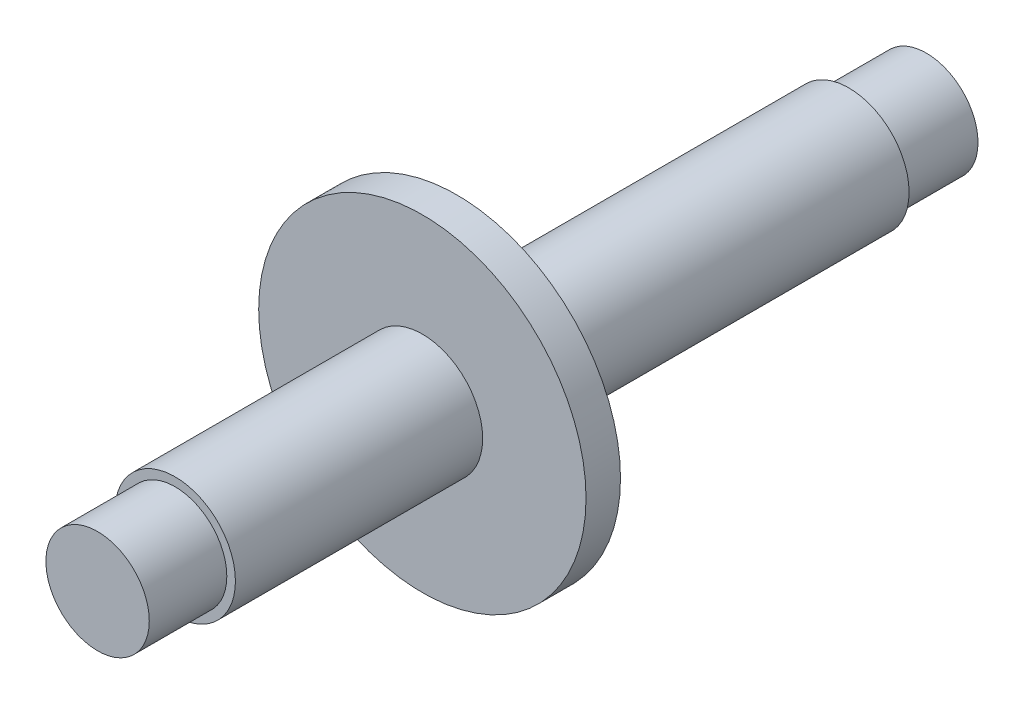
ISO-10303-21;
HEADER;
FILE_DESCRIPTION(('STEP AP214'),'2;1');
FILE_NAME('part.step','',(''),(''),'','','');
FILE_SCHEMA(('AUTOMOTIVE_DESIGN { 1 0 10303 214 1 1 1 1 }'));
ENDSEC;
DATA;
#1=APPLICATION_CONTEXT('core data for automotive mechanical design processes');
#2=APPLICATION_PROTOCOL_DEFINITION('international standard','automotive_design',2000,#1);
#3=PRODUCT_CONTEXT('',#1,'mechanical');
#4=PRODUCT('Part','Part','',(#3));
#5=PRODUCT_RELATED_PRODUCT_CATEGORY('part','',(#4));
#6=PRODUCT_DEFINITION_FORMATION('','',#4);
#7=PRODUCT_DEFINITION_CONTEXT('part definition',#1,'design');
#8=PRODUCT_DEFINITION('design','',#6,#7);
#9=PRODUCT_DEFINITION_SHAPE('','',#8);
#10=(LENGTH_UNIT() NAMED_UNIT(*) SI_UNIT(.MILLI.,.METRE.));
#11=(NAMED_UNIT(*) PLANE_ANGLE_UNIT() SI_UNIT($,.RADIAN.));
#12=(NAMED_UNIT(*) SI_UNIT($,.STERADIAN.) SOLID_ANGLE_UNIT());
#13=UNCERTAINTY_MEASURE_WITH_UNIT(LENGTH_MEASURE(1.E-05),#10,'distance_accuracy_value','');
#14=(GEOMETRIC_REPRESENTATION_CONTEXT(3) GLOBAL_UNCERTAINTY_ASSIGNED_CONTEXT((#13)) GLOBAL_UNIT_ASSIGNED_CONTEXT((#10,
#11,#12)) REPRESENTATION_CONTEXT('',''));
#15=CARTESIAN_POINT('',(0.,0.,0.));
#16=DIRECTION('',(0.,0.,1.));
#17=DIRECTION('',(1.,0.,0.));
#18=AXIS2_PLACEMENT_3D('',#15,#16,#17);
#19=CARTESIAN_POINT('',(0.,0.,4.5));
#20=DIRECTION('',(0.,0.,-1.));
#21=DIRECTION('',(-1.,0.,0.));
#22=AXIS2_PLACEMENT_3D('',#19,#20,#21);
#23=CYLINDRICAL_SURFACE('',#22,3.);
#24=CARTESIAN_POINT('',(0.,0.,4.5));
#25=DIRECTION('',(0.,0.,1.));
#26=DIRECTION('',(1.,0.,0.));
#27=AXIS2_PLACEMENT_3D('',#24,#25,#26);
#28=CIRCLE('',#27,3.);
#29=CARTESIAN_POINT('',(3.,0.,4.5));
#30=VERTEX_POINT('',#29);
#31=EDGE_CURVE('E10',#30,#30,#28,.T.);
#32=ORIENTED_EDGE('',*,*,#31,.F.);
#33=EDGE_LOOP('',(#32));
#34=FACE_BOUND('',#33,.T.);
#35=CARTESIAN_POINT('',(0.,0.,0.));
#36=DIRECTION('',(0.,0.,1.));
#37=DIRECTION('',(1.,0.,0.));
#38=AXIS2_PLACEMENT_3D('',#35,#36,#37);
#39=CIRCLE('',#38,3.);
#40=CARTESIAN_POINT('',(3.,0.,0.));
#41=VERTEX_POINT('',#40);
#42=EDGE_CURVE('E36',#41,#41,#39,.T.);
#43=ORIENTED_EDGE('',*,*,#42,.T.);
#44=EDGE_LOOP('',(#43));
#45=FACE_BOUND('',#44,.T.);
#46=ADVANCED_FACE('F33',(#34,#45),#23,.T.);
#47=CARTESIAN_POINT('',(0.,0.,0.));
#48=DIRECTION('',(0.,0.,1.));
#49=DIRECTION('',(1.,0.,0.));
#50=AXIS2_PLACEMENT_3D('',#47,#48,#49);
#51=PLANE('',#50);
#52=ORIENTED_EDGE('',*,*,#42,.F.);
#53=EDGE_LOOP('',(#52));
#54=FACE_BOUND('',#53,.T.);
#55=ADVANCED_FACE('F109',(#54),#51,.F.);
#56=CARTESIAN_POINT('',(0.,0.,27.25));
#57=DIRECTION('',(0.,0.,-1.));
#58=DIRECTION('',(-1.,0.,0.));
#59=AXIS2_PLACEMENT_3D('',#56,#57,#58);
#60=CYLINDRICAL_SURFACE('',#59,3.5);
#61=CARTESIAN_POINT('',(0.,0.,27.25));
#62=DIRECTION('',(0.,0.,1.));
#63=DIRECTION('',(1.,0.,0.));
#64=AXIS2_PLACEMENT_3D('',#61,#62,#63);
#65=CIRCLE('',#64,3.5);
#66=CARTESIAN_POINT('',(3.5,0.,27.25));
#67=VERTEX_POINT('',#66);
#68=EDGE_CURVE('E43',#67,#67,#65,.T.);
#69=ORIENTED_EDGE('',*,*,#68,.F.);
#70=EDGE_LOOP('',(#69));
#71=FACE_BOUND('',#70,.T.);
#72=CARTESIAN_POINT('',(0.,0.,4.5));
#73=DIRECTION('',(0.,0.,1.));
#74=DIRECTION('',(1.,0.,0.));
#75=AXIS2_PLACEMENT_3D('',#72,#73,#74);
#76=CIRCLE('',#75,3.5);
#77=CARTESIAN_POINT('',(3.5,0.,4.5));
#78=VERTEX_POINT('',#77);
#79=EDGE_CURVE('E45',#78,#78,#76,.T.);
#80=ORIENTED_EDGE('',*,*,#79,.T.);
#81=EDGE_LOOP('',(#80));
#82=FACE_BOUND('',#81,.T.);
#83=ADVANCED_FACE('F114',(#71,#82),#60,.T.);
#84=CARTESIAN_POINT('',(0.,0.,4.5));
#85=DIRECTION('',(0.,0.,1.));
#86=DIRECTION('',(1.,0.,0.));
#87=AXIS2_PLACEMENT_3D('',#84,#85,#86);
#88=PLANE('',#87);
#89=ORIENTED_EDGE('',*,*,#31,.T.);
#90=EDGE_LOOP('',(#89));
#91=FACE_BOUND('',#90,.T.);
#92=ORIENTED_EDGE('',*,*,#79,.F.);
#93=EDGE_LOOP('',(#92));
#94=FACE_BOUND('',#93,.T.);
#95=ADVANCED_FACE('F99',(#91,#94),#88,.F.);
#96=CARTESIAN_POINT('',(0.,0.,29.25));
#97=DIRECTION('',(0.,0.,-1.));
#98=DIRECTION('',(-1.,0.,0.));
#99=AXIS2_PLACEMENT_3D('',#96,#97,#98);
#100=CYLINDRICAL_SURFACE('',#99,9.5);
#101=CARTESIAN_POINT('',(0.,0.,29.25));
#102=DIRECTION('',(0.,0.,1.));
#103=DIRECTION('',(1.,0.,0.));
#104=AXIS2_PLACEMENT_3D('',#101,#102,#103);
#105=CIRCLE('',#104,9.5);
#106=CARTESIAN_POINT('',(9.5,0.,29.25));
#107=VERTEX_POINT('',#106);
#108=EDGE_CURVE('E48',#107,#107,#105,.T.);
#109=ORIENTED_EDGE('',*,*,#108,.F.);
#110=EDGE_LOOP('',(#109));
#111=FACE_BOUND('',#110,.T.);
#112=CARTESIAN_POINT('',(0.,0.,27.25));
#113=DIRECTION('',(0.,0.,1.));
#114=DIRECTION('',(1.,0.,0.));
#115=AXIS2_PLACEMENT_3D('',#112,#113,#114);
#116=CIRCLE('',#115,9.5);
#117=CARTESIAN_POINT('',(9.5,0.,27.25));
#118=VERTEX_POINT('',#117);
#119=EDGE_CURVE('E51',#118,#118,#116,.T.);
#120=ORIENTED_EDGE('',*,*,#119,.T.);
#121=EDGE_LOOP('',(#120));
#122=FACE_BOUND('',#121,.T.);
#123=ADVANCED_FACE('F93',(#111,#122),#100,.T.);
#124=CARTESIAN_POINT('',(0.,0.,29.25));
#125=DIRECTION('',(0.,0.,1.));
#126=DIRECTION('',(1.,0.,0.));
#127=AXIS2_PLACEMENT_3D('',#124,#125,#126);
#128=PLANE('',#127);
#129=CARTESIAN_POINT('',(0.,0.,29.25));
#130=DIRECTION('',(0.,0.,1.));
#131=DIRECTION('',(1.,0.,0.));
#132=AXIS2_PLACEMENT_3D('',#129,#130,#131);
#133=CIRCLE('',#132,3.5);
#134=CARTESIAN_POINT('',(3.5,0.,29.25));
#135=VERTEX_POINT('',#134);
#136=EDGE_CURVE('E57',#135,#135,#133,.T.);
#137=ORIENTED_EDGE('',*,*,#136,.F.);
#138=EDGE_LOOP('',(#137));
#139=FACE_BOUND('',#138,.T.);
#140=ORIENTED_EDGE('',*,*,#108,.T.);
#141=EDGE_LOOP('',(#140));
#142=FACE_BOUND('',#141,.T.);
#143=ADVANCED_FACE('F90',(#139,#142),#128,.T.);
#144=CARTESIAN_POINT('',(0.,0.,27.25));
#145=DIRECTION('',(0.,0.,1.));
#146=DIRECTION('',(1.,0.,0.));
#147=AXIS2_PLACEMENT_3D('',#144,#145,#146);
#148=PLANE('',#147);
#149=ORIENTED_EDGE('',*,*,#68,.T.);
#150=EDGE_LOOP('',(#149));
#151=FACE_BOUND('',#150,.T.);
#152=ORIENTED_EDGE('',*,*,#119,.F.);
#153=EDGE_LOOP('',(#152));
#154=FACE_BOUND('',#153,.T.);
#155=ADVANCED_FACE('F86',(#151,#154),#148,.F.);
#156=CARTESIAN_POINT('',(0.,0.,43.6));
#157=DIRECTION('',(0.,0.,-1.));
#158=DIRECTION('',(-1.,0.,0.));
#159=AXIS2_PLACEMENT_3D('',#156,#157,#158);
#160=CYLINDRICAL_SURFACE('',#159,3.5);
#161=CARTESIAN_POINT('',(0.,0.,43.6));
#162=DIRECTION('',(0.,0.,1.));
#163=DIRECTION('',(1.,0.,0.));
#164=AXIS2_PLACEMENT_3D('',#161,#162,#163);
#165=CIRCLE('',#164,3.5);
#166=CARTESIAN_POINT('',(3.5,0.,43.6));
#167=VERTEX_POINT('',#166);
#168=EDGE_CURVE('E54',#167,#167,#165,.T.);
#169=ORIENTED_EDGE('',*,*,#168,.F.);
#170=EDGE_LOOP('',(#169));
#171=FACE_BOUND('',#170,.T.);
#172=ORIENTED_EDGE('',*,*,#136,.T.);
#173=EDGE_LOOP('',(#172));
#174=FACE_BOUND('',#173,.T.);
#175=ADVANCED_FACE('F80',(#171,#174),#160,.T.);
#176=CARTESIAN_POINT('',(0.,0.,43.6));
#177=DIRECTION('',(0.,0.,1.));
#178=DIRECTION('',(1.,0.,0.));
#179=AXIS2_PLACEMENT_3D('',#176,#177,#178);
#180=PLANE('',#179);
#181=CARTESIAN_POINT('',(0.,0.,43.6));
#182=DIRECTION('',(0.,0.,1.));
#183=DIRECTION('',(1.,0.,0.));
#184=AXIS2_PLACEMENT_3D('',#181,#182,#183);
#185=CIRCLE('',#184,3.);
#186=CARTESIAN_POINT('',(3.,0.,43.6));
#187=VERTEX_POINT('',#186);
#188=EDGE_CURVE('E63',#187,#187,#185,.T.);
#189=ORIENTED_EDGE('',*,*,#188,.F.);
#190=EDGE_LOOP('',(#189));
#191=FACE_BOUND('',#190,.T.);
#192=ORIENTED_EDGE('',*,*,#168,.T.);
#193=EDGE_LOOP('',(#192));
#194=FACE_BOUND('',#193,.T.);
#195=ADVANCED_FACE('F74',(#191,#194),#180,.T.);
#196=CARTESIAN_POINT('',(0.,0.,48.1));
#197=DIRECTION('',(0.,0.,-1.));
#198=DIRECTION('',(-1.,0.,0.));
#199=AXIS2_PLACEMENT_3D('',#196,#197,#198);
#200=CYLINDRICAL_SURFACE('',#199,3.);
#201=CARTESIAN_POINT('',(0.,0.,48.1));
#202=DIRECTION('',(0.,0.,1.));
#203=DIRECTION('',(1.,0.,0.));
#204=AXIS2_PLACEMENT_3D('',#201,#202,#203);
#205=CIRCLE('',#204,3.);
#206=CARTESIAN_POINT('',(3.,0.,48.1));
#207=VERTEX_POINT('',#206);
#208=EDGE_CURVE('E60',#207,#207,#205,.T.);
#209=ORIENTED_EDGE('',*,*,#208,.F.);
#210=EDGE_LOOP('',(#209));
#211=FACE_BOUND('',#210,.T.);
#212=ORIENTED_EDGE('',*,*,#188,.T.);
#213=EDGE_LOOP('',(#212));
#214=FACE_BOUND('',#213,.T.);
#215=ADVANCED_FACE('F71',(#211,#214),#200,.T.);
#216=CARTESIAN_POINT('',(0.,0.,48.1));
#217=DIRECTION('',(0.,0.,1.));
#218=DIRECTION('',(1.,0.,0.));
#219=AXIS2_PLACEMENT_3D('',#216,#217,#218);
#220=PLANE('',#219);
#221=ORIENTED_EDGE('',*,*,#208,.T.);
#222=EDGE_LOOP('',(#221));
#223=FACE_BOUND('',#222,.T.);
#224=ADVANCED_FACE('F69',(#223),#220,.T.);
#225=CLOSED_SHELL('',(#46,#55,#83,#95,#123,#143,#155,#175,#195,#215,#224));
#226=MANIFOLD_SOLID_BREP('B2',#225);
#227=ADVANCED_BREP_SHAPE_REPRESENTATION('',(#18,#226),#14);
#228=SHAPE_DEFINITION_REPRESENTATION(#9,#227);
ENDSEC;
END-ISO-10303-21;
